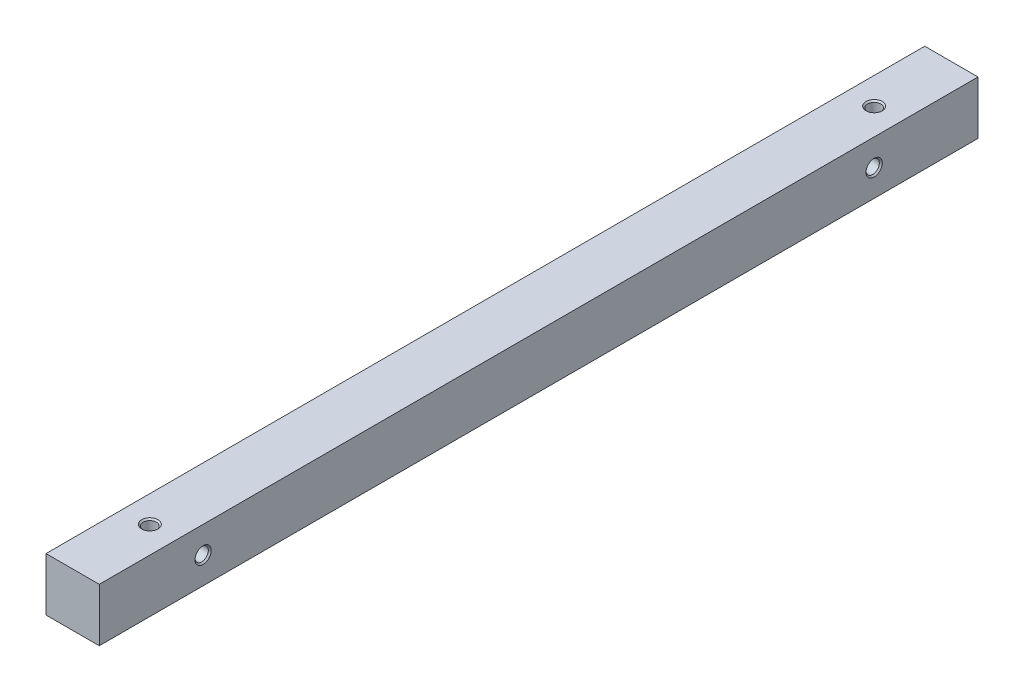
ISO-10303-21;
HEADER;
FILE_DESCRIPTION(('STEP AP214'),'2;1');
FILE_NAME('part.step','',(''),(''),'','','');
FILE_SCHEMA(('AUTOMOTIVE_DESIGN { 1 0 10303 214 1 1 1 1 }'));
ENDSEC;
DATA;
#1=APPLICATION_CONTEXT('core data for automotive mechanical design processes');
#2=APPLICATION_PROTOCOL_DEFINITION('international standard','automotive_design',2000,#1);
#3=PRODUCT_CONTEXT('',#1,'mechanical');
#4=PRODUCT('Part','Part','',(#3));
#5=PRODUCT_RELATED_PRODUCT_CATEGORY('part','',(#4));
#6=PRODUCT_DEFINITION_FORMATION('','',#4);
#7=PRODUCT_DEFINITION_CONTEXT('part definition',#1,'design');
#8=PRODUCT_DEFINITION('design','',#6,#7);
#9=PRODUCT_DEFINITION_SHAPE('','',#8);
#10=(LENGTH_UNIT() NAMED_UNIT(*) SI_UNIT(.MILLI.,.METRE.));
#11=(NAMED_UNIT(*) PLANE_ANGLE_UNIT() SI_UNIT($,.RADIAN.));
#12=(NAMED_UNIT(*) SI_UNIT($,.STERADIAN.) SOLID_ANGLE_UNIT());
#13=UNCERTAINTY_MEASURE_WITH_UNIT(LENGTH_MEASURE(1.E-05),#10,'distance_accuracy_value','');
#14=(GEOMETRIC_REPRESENTATION_CONTEXT(3) GLOBAL_UNCERTAINTY_ASSIGNED_CONTEXT((#13)) GLOBAL_UNIT_ASSIGNED_CONTEXT((#10,
#11,#12)) REPRESENTATION_CONTEXT('',''));
#15=CARTESIAN_POINT('',(0.,0.,0.));
#16=DIRECTION('',(0.,0.,1.));
#17=DIRECTION('',(1.,0.,0.));
#18=AXIS2_PLACEMENT_3D('',#15,#16,#17);
#19=CARTESIAN_POINT('',(-5.,5.,82.5));
#20=DIRECTION('',(1.,0.,0.));
#21=DIRECTION('',(0.,1.,0.));
#22=AXIS2_PLACEMENT_3D('',#19,#20,#21);
#23=PLANE('',#22);
#24=CARTESIAN_POINT('',(-5.,0.,-63.));
#25=DIRECTION('',(1.,0.,0.));
#26=DIRECTION('',(0.,0.,-1.));
#27=AXIS2_PLACEMENT_3D('',#24,#25,#26);
#28=CIRCLE('',#27,1.25);
#29=CARTESIAN_POINT('',(-5.,0.,-64.25));
#30=VERTEX_POINT('',#29);
#31=EDGE_CURVE('E119',#30,#30,#28,.T.);
#32=ORIENTED_EDGE('',*,*,#31,.T.);
#33=EDGE_LOOP('',(#32));
#34=FACE_BOUND('',#33,.T.);
#35=CARTESIAN_POINT('',(-5.,0.,63.));
#36=DIRECTION('',(1.,0.,0.));
#37=DIRECTION('',(0.,0.,-1.));
#38=AXIS2_PLACEMENT_3D('',#35,#36,#37);
#39=CIRCLE('',#38,1.25);
#40=CARTESIAN_POINT('',(-5.,0.,61.75));
#41=VERTEX_POINT('',#40);
#42=EDGE_CURVE('E100',#41,#41,#39,.T.);
#43=ORIENTED_EDGE('',*,*,#42,.T.);
#44=EDGE_LOOP('',(#43));
#45=FACE_BOUND('',#44,.T.);
#46=DIRECTION('',(0.,-1.,0.));
#47=VECTOR('',#46,1.);
#48=CARTESIAN_POINT('',(-5.,5.,-82.5));
#49=LINE('',#48,#47);
#50=CARTESIAN_POINT('',(-5.,5.,-82.5));
#51=VERTEX_POINT('',#50);
#52=CARTESIAN_POINT('',(-5.,-5.,-82.5));
#53=VERTEX_POINT('',#52);
#54=EDGE_CURVE('E97',#51,#53,#49,.T.);
#55=ORIENTED_EDGE('',*,*,#54,.T.);
#56=DIRECTION('',(0.,0.,-1.));
#57=VECTOR('',#56,1.);
#58=CARTESIAN_POINT('',(-5.,-5.,82.5));
#59=LINE('',#58,#57);
#60=CARTESIAN_POINT('',(-5.,-5.,82.5));
#61=VERTEX_POINT('',#60);
#62=EDGE_CURVE('E11',#61,#53,#59,.T.);
#63=ORIENTED_EDGE('',*,*,#62,.F.);
#64=DIRECTION('',(0.,-1.,0.));
#65=VECTOR('',#64,1.);
#66=CARTESIAN_POINT('',(-5.,5.,82.5));
#67=LINE('',#66,#65);
#68=CARTESIAN_POINT('',(-5.,5.,82.5));
#69=VERTEX_POINT('',#68);
#70=EDGE_CURVE('E85',#69,#61,#67,.T.);
#71=ORIENTED_EDGE('',*,*,#70,.F.);
#72=DIRECTION('',(0.,0.,-1.));
#73=VECTOR('',#72,1.);
#74=CARTESIAN_POINT('',(-5.,5.,82.5));
#75=LINE('',#74,#73);
#76=EDGE_CURVE('E93',#69,#51,#75,.T.);
#77=ORIENTED_EDGE('',*,*,#76,.T.);
#78=EDGE_LOOP('',(#55,#63,#71,#77));
#79=FACE_BOUND('',#78,.T.);
#80=ADVANCED_FACE('F34',(#34,#45,#79),#23,.F.);
#81=CARTESIAN_POINT('',(-5.,-5.,82.5));
#82=DIRECTION('',(0.,1.,0.));
#83=DIRECTION('',(0.,0.,1.));
#84=AXIS2_PLACEMENT_3D('',#81,#82,#83);
#85=PLANE('',#84);
#86=CARTESIAN_POINT('',(0.,-5.,-68.));
#87=DIRECTION('',(0.,1.,0.));
#88=DIRECTION('',(0.,0.,1.));
#89=AXIS2_PLACEMENT_3D('',#86,#87,#88);
#90=CIRCLE('',#89,1.25);
#91=CARTESIAN_POINT('',(0.,-5.,-66.75));
#92=VERTEX_POINT('',#91);
#93=EDGE_CURVE('E137',#92,#92,#90,.T.);
#94=ORIENTED_EDGE('',*,*,#93,.T.);
#95=EDGE_LOOP('',(#94));
#96=FACE_BOUND('',#95,.T.);
#97=CARTESIAN_POINT('',(0.,-5.,68.));
#98=DIRECTION('',(0.,1.,0.));
#99=DIRECTION('',(0.,0.,1.));
#100=AXIS2_PLACEMENT_3D('',#97,#98,#99);
#101=CIRCLE('',#100,1.25);
#102=CARTESIAN_POINT('',(0.,-5.,69.25));
#103=VERTEX_POINT('',#102);
#104=EDGE_CURVE('E128',#103,#103,#101,.T.);
#105=ORIENTED_EDGE('',*,*,#104,.T.);
#106=EDGE_LOOP('',(#105));
#107=FACE_BOUND('',#106,.T.);
#108=DIRECTION('',(1.,0.,0.));
#109=VECTOR('',#108,1.);
#110=CARTESIAN_POINT('',(-5.,-5.,-82.5));
#111=LINE('',#110,#109);
#112=CARTESIAN_POINT('',(5.,-5.,-82.5));
#113=VERTEX_POINT('',#112);
#114=EDGE_CURVE('E89',#53,#113,#111,.T.);
#115=ORIENTED_EDGE('',*,*,#114,.T.);
#116=DIRECTION('',(0.,0.,-1.));
#117=VECTOR('',#116,1.);
#118=CARTESIAN_POINT('',(5.,-5.,82.5));
#119=LINE('',#118,#117);
#120=CARTESIAN_POINT('',(5.,-5.,82.5));
#121=VERTEX_POINT('',#120);
#122=EDGE_CURVE('E42',#121,#113,#119,.T.);
#123=ORIENTED_EDGE('',*,*,#122,.F.);
#124=DIRECTION('',(1.,0.,0.));
#125=VECTOR('',#124,1.);
#126=CARTESIAN_POINT('',(-5.,-5.,82.5));
#127=LINE('',#126,#125);
#128=EDGE_CURVE('E80',#61,#121,#127,.T.);
#129=ORIENTED_EDGE('',*,*,#128,.F.);
#130=ORIENTED_EDGE('',*,*,#62,.T.);
#131=EDGE_LOOP('',(#115,#123,#129,#130));
#132=FACE_BOUND('',#131,.T.);
#133=ADVANCED_FACE('F88',(#96,#107,#132),#85,.F.);
#134=CARTESIAN_POINT('',(5.,5.,82.5));
#135=DIRECTION('',(-1.,0.,0.));
#136=DIRECTION('',(0.,-1.,0.));
#137=AXIS2_PLACEMENT_3D('',#134,#135,#136);
#138=PLANE('',#137);
#139=CARTESIAN_POINT('',(5.,0.,-63.));
#140=DIRECTION('',(1.,0.,0.));
#141=DIRECTION('',(0.,0.,-1.));
#142=AXIS2_PLACEMENT_3D('',#139,#140,#141);
#143=CIRCLE('',#142,1.525);
#144=CARTESIAN_POINT('',(5.,0.,-64.525));
#145=VERTEX_POINT('',#144);
#146=EDGE_CURVE('E125',#145,#145,#143,.T.);
#147=ORIENTED_EDGE('',*,*,#146,.F.);
#148=EDGE_LOOP('',(#147));
#149=FACE_BOUND('',#148,.T.);
#150=CARTESIAN_POINT('',(5.,0.,63.));
#151=DIRECTION('',(1.,0.,0.));
#152=DIRECTION('',(0.,0.,-1.));
#153=AXIS2_PLACEMENT_3D('',#150,#151,#152);
#154=CIRCLE('',#153,1.525);
#155=CARTESIAN_POINT('',(5.,0.,61.475));
#156=VERTEX_POINT('',#155);
#157=EDGE_CURVE('E116',#156,#156,#154,.T.);
#158=ORIENTED_EDGE('',*,*,#157,.F.);
#159=EDGE_LOOP('',(#158));
#160=FACE_BOUND('',#159,.T.);
#161=DIRECTION('',(0.,1.,0.));
#162=VECTOR('',#161,1.);
#163=CARTESIAN_POINT('',(5.,5.,-82.5));
#164=LINE('',#163,#162);
#165=CARTESIAN_POINT('',(5.,5.,-82.5));
#166=VERTEX_POINT('',#165);
#167=EDGE_CURVE('E67',#113,#166,#164,.T.);
#168=ORIENTED_EDGE('',*,*,#167,.T.);
#169=DIRECTION('',(0.,0.,-1.));
#170=VECTOR('',#169,1.);
#171=CARTESIAN_POINT('',(5.,5.,82.5));
#172=LINE('',#171,#170);
#173=CARTESIAN_POINT('',(5.,5.,82.5));
#174=VERTEX_POINT('',#173);
#175=EDGE_CURVE('E90',#174,#166,#172,.T.);
#176=ORIENTED_EDGE('',*,*,#175,.F.);
#177=DIRECTION('',(0.,1.,0.));
#178=VECTOR('',#177,1.);
#179=CARTESIAN_POINT('',(5.,5.,82.5));
#180=LINE('',#179,#178);
#181=EDGE_CURVE('E83',#121,#174,#180,.T.);
#182=ORIENTED_EDGE('',*,*,#181,.F.);
#183=ORIENTED_EDGE('',*,*,#122,.T.);
#184=EDGE_LOOP('',(#168,#176,#182,#183));
#185=FACE_BOUND('',#184,.T.);
#186=ADVANCED_FACE('F91',(#149,#160,#185),#138,.F.);
#187=CARTESIAN_POINT('',(-5.,5.,82.5));
#188=DIRECTION('',(0.,-1.,0.));
#189=DIRECTION('',(0.,0.,-1.));
#190=AXIS2_PLACEMENT_3D('',#187,#188,#189);
#191=PLANE('',#190);
#192=CARTESIAN_POINT('',(0.,5.,-68.));
#193=DIRECTION('',(0.,1.,0.));
#194=DIRECTION('',(0.,0.,1.));
#195=AXIS2_PLACEMENT_3D('',#192,#193,#194);
#196=CIRCLE('',#195,1.525);
#197=CARTESIAN_POINT('',(0.,5.,-66.475));
#198=VERTEX_POINT('',#197);
#199=EDGE_CURVE('E143',#198,#198,#196,.T.);
#200=ORIENTED_EDGE('',*,*,#199,.F.);
#201=EDGE_LOOP('',(#200));
#202=FACE_BOUND('',#201,.T.);
#203=CARTESIAN_POINT('',(0.,5.,68.));
#204=DIRECTION('',(0.,1.,0.));
#205=DIRECTION('',(0.,0.,1.));
#206=AXIS2_PLACEMENT_3D('',#203,#204,#205);
#207=CIRCLE('',#206,1.525);
#208=CARTESIAN_POINT('',(0.,5.,69.525));
#209=VERTEX_POINT('',#208);
#210=EDGE_CURVE('E134',#209,#209,#207,.T.);
#211=ORIENTED_EDGE('',*,*,#210,.F.);
#212=EDGE_LOOP('',(#211));
#213=FACE_BOUND('',#212,.T.);
#214=DIRECTION('',(-1.,0.,0.));
#215=VECTOR('',#214,1.);
#216=CARTESIAN_POINT('',(-5.,5.,-82.5));
#217=LINE('',#216,#215);
#218=EDGE_CURVE('E73',#166,#51,#217,.T.);
#219=ORIENTED_EDGE('',*,*,#218,.T.);
#220=ORIENTED_EDGE('',*,*,#76,.F.);
#221=DIRECTION('',(-1.,0.,0.));
#222=VECTOR('',#221,1.);
#223=CARTESIAN_POINT('',(-5.,5.,82.5));
#224=LINE('',#223,#222);
#225=EDGE_CURVE('E50',#174,#69,#224,.T.);
#226=ORIENTED_EDGE('',*,*,#225,.F.);
#227=ORIENTED_EDGE('',*,*,#175,.T.);
#228=EDGE_LOOP('',(#219,#220,#226,#227));
#229=FACE_BOUND('',#228,.T.);
#230=ADVANCED_FACE('F105',(#202,#213,#229),#191,.F.);
#231=CARTESIAN_POINT('',(0.,0.,82.5));
#232=DIRECTION('',(0.,0.,1.));
#233=DIRECTION('',(1.,0.,0.));
#234=AXIS2_PLACEMENT_3D('',#231,#232,#233);
#235=PLANE('',#234);
#236=ORIENTED_EDGE('',*,*,#70,.T.);
#237=ORIENTED_EDGE('',*,*,#128,.T.);
#238=ORIENTED_EDGE('',*,*,#181,.T.);
#239=ORIENTED_EDGE('',*,*,#225,.T.);
#240=EDGE_LOOP('',(#236,#237,#238,#239));
#241=FACE_BOUND('',#240,.T.);
#242=ADVANCED_FACE('F81',(#241),#235,.T.);
#243=CARTESIAN_POINT('',(0.,0.,-82.5));
#244=DIRECTION('',(0.,0.,1.));
#245=DIRECTION('',(1.,0.,0.));
#246=AXIS2_PLACEMENT_3D('',#243,#244,#245);
#247=PLANE('',#246);
#248=ORIENTED_EDGE('',*,*,#54,.F.);
#249=ORIENTED_EDGE('',*,*,#218,.F.);
#250=ORIENTED_EDGE('',*,*,#167,.F.);
#251=ORIENTED_EDGE('',*,*,#114,.F.);
#252=EDGE_LOOP('',(#248,#249,#250,#251));
#253=FACE_BOUND('',#252,.T.);
#254=ADVANCED_FACE('F108',(#253),#247,.F.);
#255=CARTESIAN_POINT('',(5.,0.,63.));
#256=DIRECTION('',(1.,0.,0.));
#257=DIRECTION('',(0.,0.,-1.));
#258=AXIS2_PLACEMENT_3D('',#255,#256,#257);
#259=CYLINDRICAL_SURFACE('',#258,1.25);
#260=ORIENTED_EDGE('',*,*,#42,.F.);
#261=EDGE_LOOP('',(#260));
#262=FACE_BOUND('',#261,.T.);
#263=CARTESIAN_POINT('',(4.725,0.,63.));
#264=DIRECTION('',(1.,0.,0.));
#265=DIRECTION('',(0.,0.,-1.));
#266=AXIS2_PLACEMENT_3D('',#263,#264,#265);
#267=CIRCLE('',#266,1.25);
#268=CARTESIAN_POINT('',(4.725,0.,61.75));
#269=VERTEX_POINT('',#268);
#270=EDGE_CURVE('E113',#269,#269,#267,.T.);
#271=ORIENTED_EDGE('',*,*,#270,.T.);
#272=EDGE_LOOP('',(#271));
#273=FACE_BOUND('',#272,.T.);
#274=ADVANCED_FACE('F180',(#262,#273),#259,.F.);
#275=CARTESIAN_POINT('',(5.,0.,63.));
#276=DIRECTION('',(1.,0.,0.));
#277=DIRECTION('',(0.,0.,-1.));
#278=AXIS2_PLACEMENT_3D('',#275,#276,#277);
#279=CONICAL_SURFACE('',#278,1.525,0.785398163397449);
#280=ORIENTED_EDGE('',*,*,#270,.F.);
#281=EDGE_LOOP('',(#280));
#282=FACE_BOUND('',#281,.T.);
#283=ORIENTED_EDGE('',*,*,#157,.T.);
#284=EDGE_LOOP('',(#283));
#285=FACE_BOUND('',#284,.T.);
#286=ADVANCED_FACE('F183',(#282,#285),#279,.F.);
#287=CARTESIAN_POINT('',(5.,0.,-63.));
#288=DIRECTION('',(1.,0.,0.));
#289=DIRECTION('',(0.,0.,-1.));
#290=AXIS2_PLACEMENT_3D('',#287,#288,#289);
#291=CYLINDRICAL_SURFACE('',#290,1.25);
#292=ORIENTED_EDGE('',*,*,#31,.F.);
#293=EDGE_LOOP('',(#292));
#294=FACE_BOUND('',#293,.T.);
#295=CARTESIAN_POINT('',(4.725,0.,-63.));
#296=DIRECTION('',(1.,0.,0.));
#297=DIRECTION('',(0.,0.,-1.));
#298=AXIS2_PLACEMENT_3D('',#295,#296,#297);
#299=CIRCLE('',#298,1.25);
#300=CARTESIAN_POINT('',(4.725,0.,-64.25));
#301=VERTEX_POINT('',#300);
#302=EDGE_CURVE('E122',#301,#301,#299,.T.);
#303=ORIENTED_EDGE('',*,*,#302,.T.);
#304=EDGE_LOOP('',(#303));
#305=FACE_BOUND('',#304,.T.);
#306=ADVANCED_FACE('F189',(#294,#305),#291,.F.);
#307=CARTESIAN_POINT('',(5.,0.,-63.));
#308=DIRECTION('',(1.,0.,0.));
#309=DIRECTION('',(0.,0.,-1.));
#310=AXIS2_PLACEMENT_3D('',#307,#308,#309);
#311=CONICAL_SURFACE('',#310,1.525,0.785398163397449);
#312=ORIENTED_EDGE('',*,*,#302,.F.);
#313=EDGE_LOOP('',(#312));
#314=FACE_BOUND('',#313,.T.);
#315=ORIENTED_EDGE('',*,*,#146,.T.);
#316=EDGE_LOOP('',(#315));
#317=FACE_BOUND('',#316,.T.);
#318=ADVANCED_FACE('F166',(#314,#317),#311,.F.);
#319=CARTESIAN_POINT('',(0.,5.,68.));
#320=DIRECTION('',(0.,1.,0.));
#321=DIRECTION('',(0.,0.,1.));
#322=AXIS2_PLACEMENT_3D('',#319,#320,#321);
#323=CYLINDRICAL_SURFACE('',#322,1.25);
#324=ORIENTED_EDGE('',*,*,#104,.F.);
#325=EDGE_LOOP('',(#324));
#326=FACE_BOUND('',#325,.T.);
#327=CARTESIAN_POINT('',(0.,4.725,68.));
#328=DIRECTION('',(0.,1.,0.));
#329=DIRECTION('',(0.,0.,1.));
#330=AXIS2_PLACEMENT_3D('',#327,#328,#329);
#331=CIRCLE('',#330,1.25);
#332=CARTESIAN_POINT('',(0.,4.725,69.25));
#333=VERTEX_POINT('',#332);
#334=EDGE_CURVE('E131',#333,#333,#331,.T.);
#335=ORIENTED_EDGE('',*,*,#334,.T.);
#336=EDGE_LOOP('',(#335));
#337=FACE_BOUND('',#336,.T.);
#338=ADVANCED_FACE('F157',(#326,#337),#323,.F.);
#339=CARTESIAN_POINT('',(0.,5.,68.));
#340=DIRECTION('',(0.,1.,0.));
#341=DIRECTION('',(0.,0.,1.));
#342=AXIS2_PLACEMENT_3D('',#339,#340,#341);
#343=CONICAL_SURFACE('',#342,1.525,0.785398163397449);
#344=ORIENTED_EDGE('',*,*,#334,.F.);
#345=EDGE_LOOP('',(#344));
#346=FACE_BOUND('',#345,.T.);
#347=ORIENTED_EDGE('',*,*,#210,.T.);
#348=EDGE_LOOP('',(#347));
#349=FACE_BOUND('',#348,.T.);
#350=ADVANCED_FACE('F154',(#346,#349),#343,.F.);
#351=CARTESIAN_POINT('',(0.,5.,-68.));
#352=DIRECTION('',(0.,1.,0.));
#353=DIRECTION('',(0.,0.,1.));
#354=AXIS2_PLACEMENT_3D('',#351,#352,#353);
#355=CYLINDRICAL_SURFACE('',#354,1.25);
#356=ORIENTED_EDGE('',*,*,#93,.F.);
#357=EDGE_LOOP('',(#356));
#358=FACE_BOUND('',#357,.T.);
#359=CARTESIAN_POINT('',(0.,4.725,-68.));
#360=DIRECTION('',(0.,1.,0.));
#361=DIRECTION('',(0.,0.,1.));
#362=AXIS2_PLACEMENT_3D('',#359,#360,#361);
#363=CIRCLE('',#362,1.25);
#364=CARTESIAN_POINT('',(0.,4.725,-66.75));
#365=VERTEX_POINT('',#364);
#366=EDGE_CURVE('E140',#365,#365,#363,.T.);
#367=ORIENTED_EDGE('',*,*,#366,.T.);
#368=EDGE_LOOP('',(#367));
#369=FACE_BOUND('',#368,.T.);
#370=ADVANCED_FACE('F156',(#358,#369),#355,.F.);
#371=CARTESIAN_POINT('',(0.,5.,-68.));
#372=DIRECTION('',(0.,1.,0.));
#373=DIRECTION('',(0.,0.,1.));
#374=AXIS2_PLACEMENT_3D('',#371,#372,#373);
#375=CONICAL_SURFACE('',#374,1.525,0.785398163397449);
#376=ORIENTED_EDGE('',*,*,#366,.F.);
#377=EDGE_LOOP('',(#376));
#378=FACE_BOUND('',#377,.T.);
#379=ORIENTED_EDGE('',*,*,#199,.T.);
#380=EDGE_LOOP('',(#379));
#381=FACE_BOUND('',#380,.T.);
#382=ADVANCED_FACE('F147',(#378,#381),#375,.F.);
#383=CLOSED_SHELL('',(#80,#133,#186,#230,#242,#254,#274,#286,#306,#318,#338,#350,#370,#382));
#384=MANIFOLD_SOLID_BREP('B2',#383);
#385=ADVANCED_BREP_SHAPE_REPRESENTATION('',(#18,#384),#14);
#386=SHAPE_DEFINITION_REPRESENTATION(#9,#385);
ENDSEC;
END-ISO-10303-21;
